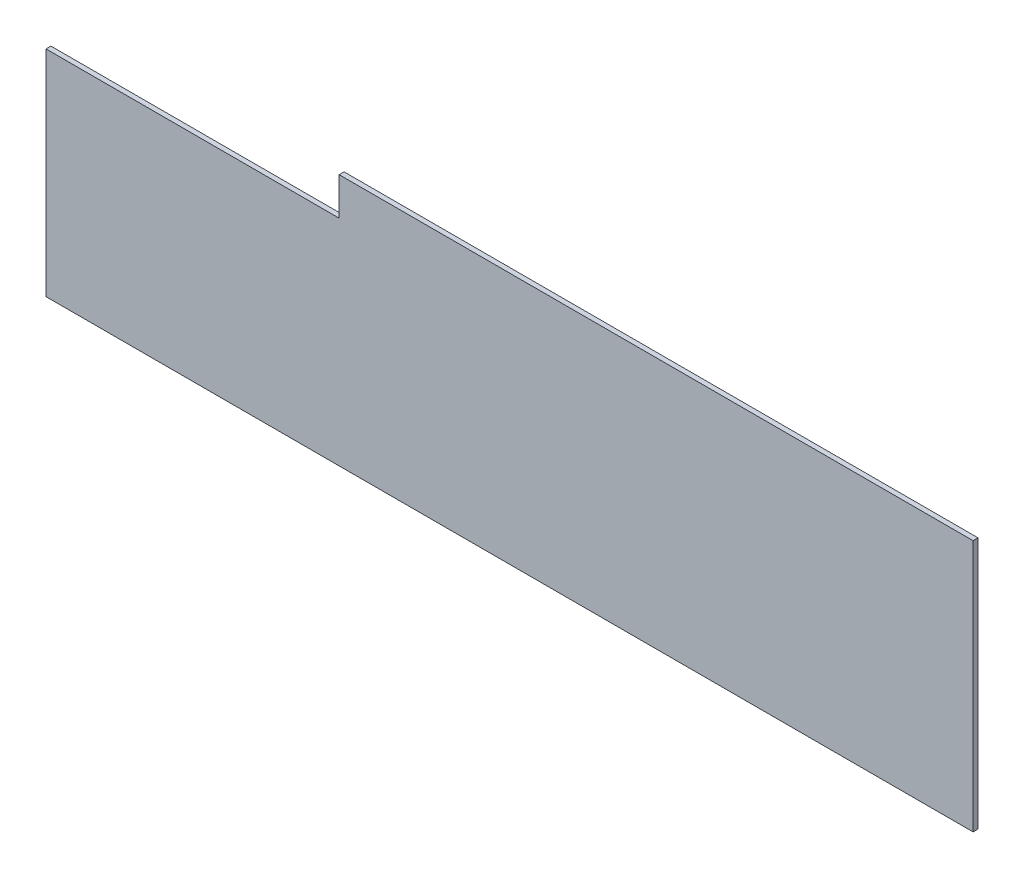
ISO-10303-21;
HEADER;
FILE_DESCRIPTION(('STEP AP214'),'2;1');
FILE_NAME('part.step','',(''),(''),'','','');
FILE_SCHEMA(('AUTOMOTIVE_DESIGN { 1 0 10303 214 1 1 1 1 }'));
ENDSEC;
DATA;
#1=APPLICATION_CONTEXT('core data for automotive mechanical design processes');
#2=APPLICATION_PROTOCOL_DEFINITION('international standard','automotive_design',2000,#1);
#3=PRODUCT_CONTEXT('',#1,'mechanical');
#4=PRODUCT('Part','Part','',(#3));
#5=PRODUCT_RELATED_PRODUCT_CATEGORY('part','',(#4));
#6=PRODUCT_DEFINITION_FORMATION('','',#4);
#7=PRODUCT_DEFINITION_CONTEXT('part definition',#1,'design');
#8=PRODUCT_DEFINITION('design','',#6,#7);
#9=PRODUCT_DEFINITION_SHAPE('','',#8);
#10=(LENGTH_UNIT() NAMED_UNIT(*) SI_UNIT(.MILLI.,.METRE.));
#11=(NAMED_UNIT(*) PLANE_ANGLE_UNIT() SI_UNIT($,.RADIAN.));
#12=(NAMED_UNIT(*) SI_UNIT($,.STERADIAN.) SOLID_ANGLE_UNIT());
#13=UNCERTAINTY_MEASURE_WITH_UNIT(LENGTH_MEASURE(1.E-05),#10,'distance_accuracy_value','');
#14=(GEOMETRIC_REPRESENTATION_CONTEXT(3) GLOBAL_UNCERTAINTY_ASSIGNED_CONTEXT((#13)) GLOBAL_UNIT_ASSIGNED_CONTEXT((#10,
#11,#12)) REPRESENTATION_CONTEXT('',''));
#15=CARTESIAN_POINT('',(0.,0.,0.));
#16=DIRECTION('',(0.,0.,1.));
#17=DIRECTION('',(1.,0.,0.));
#18=AXIS2_PLACEMENT_3D('',#15,#16,#17);
#19=CARTESIAN_POINT('',(6025.,-1.33622893420292E-13,-30.));
#20=DIRECTION('',(0.,1.,0.));
#21=DIRECTION('',(-1.,0.,0.));
#22=AXIS2_PLACEMENT_3D('',#19,#20,#21);
#23=PLANE('',#22);
#24=DIRECTION('',(-1.,0.,0.));
#25=VECTOR('',#24,1.);
#26=CARTESIAN_POINT('',(6025.,-1.33622893420292E-13,-30.));
#27=LINE('',#26,#25);
#28=CARTESIAN_POINT('',(6025.,-1.33622893420292E-13,-30.));
#29=VERTEX_POINT('',#28);
#30=CARTESIAN_POINT('',(2155.,0.,-30.));
#31=VERTEX_POINT('',#30);
#32=EDGE_CURVE('E106',#29,#31,#27,.T.);
#33=ORIENTED_EDGE('',*,*,#32,.T.);
#34=DIRECTION('',(0.,0.,1.));
#35=VECTOR('',#34,1.);
#36=CARTESIAN_POINT('',(2155.,0.,-30.));
#37=LINE('',#36,#35);
#38=CARTESIAN_POINT('',(2155.,0.,0.));
#39=VERTEX_POINT('',#38);
#40=EDGE_CURVE('E124',#31,#39,#37,.T.);
#41=ORIENTED_EDGE('',*,*,#40,.T.);
#42=DIRECTION('',(-1.,0.,0.));
#43=VECTOR('',#42,1.);
#44=CARTESIAN_POINT('',(6025.,-1.33622893420292E-13,0.));
#45=LINE('',#44,#43);
#46=CARTESIAN_POINT('',(6025.,-1.33622893420292E-13,0.));
#47=VERTEX_POINT('',#46);
#48=EDGE_CURVE('E127',#47,#39,#45,.T.);
#49=ORIENTED_EDGE('',*,*,#48,.F.);
#50=DIRECTION('',(0.,0.,1.));
#51=VECTOR('',#50,1.);
#52=CARTESIAN_POINT('',(6025.,-1.33622893420292E-13,-30.));
#53=LINE('',#52,#51);
#54=EDGE_CURVE('E54',#29,#47,#53,.T.);
#55=ORIENTED_EDGE('',*,*,#54,.F.);
#56=EDGE_LOOP('',(#33,#41,#49,#55));
#57=FACE_BOUND('',#56,.T.);
#58=ADVANCED_FACE('F38',(#57),#23,.T.);
#59=CARTESIAN_POINT('',(0.,0.,-30.));
#60=DIRECTION('',(0.,0.,1.));
#61=DIRECTION('',(1.,0.,0.));
#62=AXIS2_PLACEMENT_3D('',#59,#60,#61);
#63=PLANE('',#62);
#64=DIRECTION('',(0.,-1.,0.));
#65=VECTOR('',#64,1.);
#66=CARTESIAN_POINT('',(2155.,0.,-30.));
#67=LINE('',#66,#65);
#68=CARTESIAN_POINT('',(2155.,-230.,-30.));
#69=VERTEX_POINT('',#68);
#70=EDGE_CURVE('E116',#31,#69,#67,.T.);
#71=ORIENTED_EDGE('',*,*,#70,.F.);
#72=ORIENTED_EDGE('',*,*,#32,.F.);
#73=DIRECTION('',(0.,1.,0.));
#74=VECTOR('',#73,1.);
#75=CARTESIAN_POINT('',(6025.,-1540.,-30.));
#76=LINE('',#75,#74);
#77=CARTESIAN_POINT('',(6025.,-1540.,-30.));
#78=VERTEX_POINT('',#77);
#79=EDGE_CURVE('E132',#78,#29,#76,.T.);
#80=ORIENTED_EDGE('',*,*,#79,.F.);
#81=DIRECTION('',(1.,0.,0.));
#82=VECTOR('',#81,1.);
#83=CARTESIAN_POINT('',(365.,-1540.,-30.));
#84=LINE('',#83,#82);
#85=CARTESIAN_POINT('',(365.,-1540.,-30.));
#86=VERTEX_POINT('',#85);
#87=EDGE_CURVE('E104',#86,#78,#84,.T.);
#88=ORIENTED_EDGE('',*,*,#87,.F.);
#89=DIRECTION('',(0.,-1.,0.));
#90=VECTOR('',#89,1.);
#91=CARTESIAN_POINT('',(365.,-1015.,-30.));
#92=LINE('',#91,#90);
#93=CARTESIAN_POINT('',(365.,-230.,-30.));
#94=VERTEX_POINT('',#93);
#95=EDGE_CURVE('E97',#94,#86,#92,.T.);
#96=ORIENTED_EDGE('',*,*,#95,.F.);
#97=DIRECTION('',(1.,0.,0.));
#98=VECTOR('',#97,1.);
#99=CARTESIAN_POINT('',(0.,-230.,-30.));
#100=LINE('',#99,#98);
#101=EDGE_CURVE('E102',#94,#69,#100,.T.);
#102=ORIENTED_EDGE('',*,*,#101,.T.);
#103=EDGE_LOOP('',(#71,#72,#80,#88,#96,#102));
#104=FACE_BOUND('',#103,.T.);
#105=ADVANCED_FACE('F100',(#104),#63,.F.);
#106=CARTESIAN_POINT('',(0.,0.,0.));
#107=DIRECTION('',(0.,0.,1.));
#108=DIRECTION('',(1.,0.,0.));
#109=AXIS2_PLACEMENT_3D('',#106,#107,#108);
#110=PLANE('',#109);
#111=ORIENTED_EDGE('',*,*,#48,.T.);
#112=DIRECTION('',(0.,-1.,0.));
#113=VECTOR('',#112,1.);
#114=CARTESIAN_POINT('',(2155.,0.,0.));
#115=LINE('',#114,#113);
#116=CARTESIAN_POINT('',(2155.,-230.,0.));
#117=VERTEX_POINT('',#116);
#118=EDGE_CURVE('E11',#39,#117,#115,.T.);
#119=ORIENTED_EDGE('',*,*,#118,.T.);
#120=DIRECTION('',(1.,0.,0.));
#121=VECTOR('',#120,1.);
#122=CARTESIAN_POINT('',(0.,-230.,0.));
#123=LINE('',#122,#121);
#124=CARTESIAN_POINT('',(365.,-230.,0.));
#125=VERTEX_POINT('',#124);
#126=EDGE_CURVE('E46',#125,#117,#123,.T.);
#127=ORIENTED_EDGE('',*,*,#126,.F.);
#128=DIRECTION('',(0.,-1.,0.));
#129=VECTOR('',#128,1.);
#130=CARTESIAN_POINT('',(365.,-1015.,0.));
#131=LINE('',#130,#129);
#132=CARTESIAN_POINT('',(365.,-1540.,0.));
#133=VERTEX_POINT('',#132);
#134=EDGE_CURVE('E112',#125,#133,#131,.T.);
#135=ORIENTED_EDGE('',*,*,#134,.T.);
#136=DIRECTION('',(1.,0.,0.));
#137=VECTOR('',#136,1.);
#138=CARTESIAN_POINT('',(365.,-1540.,0.));
#139=LINE('',#138,#137);
#140=CARTESIAN_POINT('',(6025.,-1540.,0.));
#141=VERTEX_POINT('',#140);
#142=EDGE_CURVE('E137',#133,#141,#139,.T.);
#143=ORIENTED_EDGE('',*,*,#142,.T.);
#144=DIRECTION('',(0.,1.,0.));
#145=VECTOR('',#144,1.);
#146=CARTESIAN_POINT('',(6025.,-1540.,0.));
#147=LINE('',#146,#145);
#148=EDGE_CURVE('E129',#141,#47,#147,.T.);
#149=ORIENTED_EDGE('',*,*,#148,.T.);
#150=EDGE_LOOP('',(#111,#119,#127,#135,#143,#149));
#151=FACE_BOUND('',#150,.T.);
#152=ADVANCED_FACE('F146',(#151),#110,.T.);
#153=CARTESIAN_POINT('',(6025.,-1540.,-30.));
#154=DIRECTION('',(1.,0.,0.));
#155=DIRECTION('',(0.,0.,-1.));
#156=AXIS2_PLACEMENT_3D('',#153,#154,#155);
#157=PLANE('',#156);
#158=ORIENTED_EDGE('',*,*,#148,.F.);
#159=DIRECTION('',(0.,0.,1.));
#160=VECTOR('',#159,1.);
#161=CARTESIAN_POINT('',(6025.,-1540.,-30.));
#162=LINE('',#161,#160);
#163=EDGE_CURVE('E69',#78,#141,#162,.T.);
#164=ORIENTED_EDGE('',*,*,#163,.F.);
#165=ORIENTED_EDGE('',*,*,#79,.T.);
#166=ORIENTED_EDGE('',*,*,#54,.T.);
#167=EDGE_LOOP('',(#158,#164,#165,#166));
#168=FACE_BOUND('',#167,.T.);
#169=ADVANCED_FACE('F147',(#168),#157,.T.);
#170=CARTESIAN_POINT('',(365.,-1540.,-30.));
#171=DIRECTION('',(0.,-1.,0.));
#172=DIRECTION('',(0.,0.,-1.));
#173=AXIS2_PLACEMENT_3D('',#170,#171,#172);
#174=PLANE('',#173);
#175=ORIENTED_EDGE('',*,*,#142,.F.);
#176=DIRECTION('',(0.,0.,1.));
#177=VECTOR('',#176,1.);
#178=CARTESIAN_POINT('',(365.,-1540.,-30.));
#179=LINE('',#178,#177);
#180=EDGE_CURVE('E75',#86,#133,#179,.T.);
#181=ORIENTED_EDGE('',*,*,#180,.F.);
#182=ORIENTED_EDGE('',*,*,#87,.T.);
#183=ORIENTED_EDGE('',*,*,#163,.T.);
#184=EDGE_LOOP('',(#175,#181,#182,#183));
#185=FACE_BOUND('',#184,.T.);
#186=ADVANCED_FACE('F148',(#185),#174,.T.);
#187=CARTESIAN_POINT('',(365.,-1015.,-30.));
#188=DIRECTION('',(-1.,0.,0.));
#189=DIRECTION('',(0.,-1.,0.));
#190=AXIS2_PLACEMENT_3D('',#187,#188,#189);
#191=PLANE('',#190);
#192=ORIENTED_EDGE('',*,*,#134,.F.);
#193=DIRECTION('',(0.,0.,1.));
#194=VECTOR('',#193,1.);
#195=CARTESIAN_POINT('',(365.,-230.,-30.));
#196=LINE('',#195,#194);
#197=EDGE_CURVE('E109',#94,#125,#196,.T.);
#198=ORIENTED_EDGE('',*,*,#197,.F.);
#199=ORIENTED_EDGE('',*,*,#95,.T.);
#200=ORIENTED_EDGE('',*,*,#180,.T.);
#201=EDGE_LOOP('',(#192,#198,#199,#200));
#202=FACE_BOUND('',#201,.T.);
#203=ADVANCED_FACE('F110',(#202),#191,.T.);
#204=CARTESIAN_POINT('',(2155.,0.,-30.));
#205=DIRECTION('',(-1.,0.,0.));
#206=DIRECTION('',(0.,0.,1.));
#207=AXIS2_PLACEMENT_3D('',#204,#205,#206);
#208=PLANE('',#207);
#209=ORIENTED_EDGE('',*,*,#40,.F.);
#210=ORIENTED_EDGE('',*,*,#70,.T.);
#211=DIRECTION('',(0.,0.,1.));
#212=VECTOR('',#211,1.);
#213=CARTESIAN_POINT('',(2155.,-230.,-30.));
#214=LINE('',#213,#212);
#215=EDGE_CURVE('E115',#69,#117,#214,.T.);
#216=ORIENTED_EDGE('',*,*,#215,.T.);
#217=ORIENTED_EDGE('',*,*,#118,.F.);
#218=EDGE_LOOP('',(#209,#210,#216,#217));
#219=FACE_BOUND('',#218,.T.);
#220=ADVANCED_FACE('F145',(#219),#208,.T.);
#221=CARTESIAN_POINT('',(0.,-230.,-30.));
#222=DIRECTION('',(0.,-1.,0.));
#223=DIRECTION('',(1.,0.,0.));
#224=AXIS2_PLACEMENT_3D('',#221,#222,#223);
#225=PLANE('',#224);
#226=ORIENTED_EDGE('',*,*,#126,.T.);
#227=ORIENTED_EDGE('',*,*,#215,.F.);
#228=ORIENTED_EDGE('',*,*,#101,.F.);
#229=ORIENTED_EDGE('',*,*,#197,.T.);
#230=EDGE_LOOP('',(#226,#227,#228,#229));
#231=FACE_BOUND('',#230,.T.);
#232=ADVANCED_FACE('F119',(#231),#225,.F.);
#233=CLOSED_SHELL('',(#58,#105,#152,#169,#186,#203,#220,#232));
#234=MANIFOLD_SOLID_BREP('B2',#233);
#235=ADVANCED_BREP_SHAPE_REPRESENTATION('',(#18,#234),#14);
#236=SHAPE_DEFINITION_REPRESENTATION(#9,#235);
ENDSEC;
END-ISO-10303-21;
